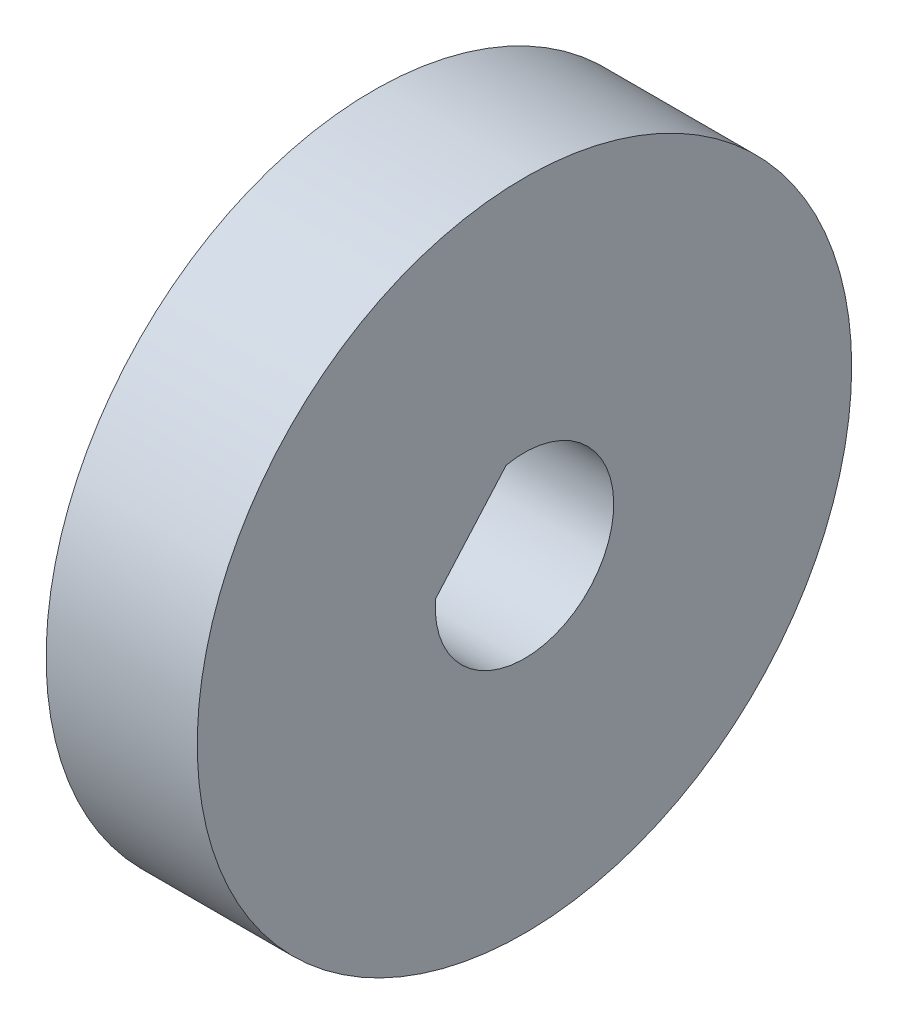
ISO-10303-21;
HEADER;
FILE_DESCRIPTION(('STEP AP214'),'2;1');
FILE_NAME('part.step','',(''),(''),'','','');
FILE_SCHEMA(('AUTOMOTIVE_DESIGN { 1 0 10303 214 1 1 1 1 }'));
ENDSEC;
DATA;
#1=APPLICATION_CONTEXT('core data for automotive mechanical design processes');
#2=APPLICATION_PROTOCOL_DEFINITION('international standard','automotive_design',2000,#1);
#3=PRODUCT_CONTEXT('',#1,'mechanical');
#4=PRODUCT('Part','Part','',(#3));
#5=PRODUCT_RELATED_PRODUCT_CATEGORY('part','',(#4));
#6=PRODUCT_DEFINITION_FORMATION('','',#4);
#7=PRODUCT_DEFINITION_CONTEXT('part definition',#1,'design');
#8=PRODUCT_DEFINITION('design','',#6,#7);
#9=PRODUCT_DEFINITION_SHAPE('','',#8);
#10=(LENGTH_UNIT() NAMED_UNIT(*) SI_UNIT(.MILLI.,.METRE.));
#11=(NAMED_UNIT(*) PLANE_ANGLE_UNIT() SI_UNIT($,.RADIAN.));
#12=(NAMED_UNIT(*) SI_UNIT($,.STERADIAN.) SOLID_ANGLE_UNIT());
#13=UNCERTAINTY_MEASURE_WITH_UNIT(LENGTH_MEASURE(1.E-05),#10,'distance_accuracy_value','');
#14=(GEOMETRIC_REPRESENTATION_CONTEXT(3) GLOBAL_UNCERTAINTY_ASSIGNED_CONTEXT((#13)) GLOBAL_UNIT_ASSIGNED_CONTEXT((#10,
#11,#12)) REPRESENTATION_CONTEXT('',''));
#15=CARTESIAN_POINT('',(0.,0.,0.));
#16=DIRECTION('',(0.,0.,1.));
#17=DIRECTION('',(1.,0.,0.));
#18=AXIS2_PLACEMENT_3D('',#15,#16,#17);
#19=CARTESIAN_POINT('',(5.08,0.,0.));
#20=DIRECTION('',(-1.,0.,0.));
#21=DIRECTION('',(0.,0.,1.));
#22=AXIS2_PLACEMENT_3D('',#19,#20,#21);
#23=CYLINDRICAL_SURFACE('',#22,11.);
#24=CARTESIAN_POINT('',(5.08,0.,0.));
#25=DIRECTION('',(1.,0.,0.));
#26=DIRECTION('',(0.,0.,-1.));
#27=AXIS2_PLACEMENT_3D('',#24,#25,#26);
#28=CIRCLE('',#27,11.);
#29=CARTESIAN_POINT('',(5.08,0.,-11.));
#30=VERTEX_POINT('',#29);
#31=EDGE_CURVE('E11',#30,#30,#28,.T.);
#32=ORIENTED_EDGE('',*,*,#31,.F.);
#33=EDGE_LOOP('',(#32));
#34=FACE_BOUND('',#33,.T.);
#35=CARTESIAN_POINT('',(0.,0.,0.));
#36=DIRECTION('',(1.,0.,0.));
#37=DIRECTION('',(0.,0.,-1.));
#38=AXIS2_PLACEMENT_3D('',#35,#36,#37);
#39=CIRCLE('',#38,11.);
#40=CARTESIAN_POINT('',(0.,0.,-11.));
#41=VERTEX_POINT('',#40);
#42=EDGE_CURVE('E35',#41,#41,#39,.T.);
#43=ORIENTED_EDGE('',*,*,#42,.T.);
#44=EDGE_LOOP('',(#43));
#45=FACE_BOUND('',#44,.T.);
#46=ADVANCED_FACE('F32',(#34,#45),#23,.T.);
#47=CARTESIAN_POINT('',(5.08,0.,0.));
#48=DIRECTION('',(1.,0.,0.));
#49=DIRECTION('',(0.,0.,-1.));
#50=AXIS2_PLACEMENT_3D('',#47,#48,#49);
#51=PLANE('',#50);
#52=CARTESIAN_POINT('',(5.08,0.,0.));
#53=DIRECTION('',(1.,0.,0.));
#54=DIRECTION('',(0.,0.,-1.));
#55=AXIS2_PLACEMENT_3D('',#52,#53,#54);
#56=CIRCLE('',#55,3.00000000000001);
#57=CARTESIAN_POINT('',(5.08,2.93621108774967,0.615357171223387));
#58=VERTEX_POINT('',#57);
#59=CARTESIAN_POINT('',(5.08,0.231396220195473,2.99106265218221));
#60=VERTEX_POINT('',#59);
#61=EDGE_CURVE('E67',#58,#60,#56,.F.);
#62=ORIENTED_EDGE('',*,*,#61,.T.);
#63=DIRECTION('',(0.,0.751337463209498,-0.659918189155229));
#64=VECTOR('',#63,1.);
#65=CARTESIAN_POINT('',(5.08,2.93621108774967,0.615357171223387));
#66=LINE('',#65,#64);
#67=EDGE_CURVE('E59',#60,#58,#66,.T.);
#68=ORIENTED_EDGE('',*,*,#67,.T.);
#69=EDGE_LOOP('',(#62,#68));
#70=FACE_BOUND('',#69,.T.);
#71=ORIENTED_EDGE('',*,*,#31,.T.);
#72=EDGE_LOOP('',(#71));
#73=FACE_BOUND('',#72,.T.);
#74=ADVANCED_FACE('F70',(#70,#73),#51,.T.);
#75=CARTESIAN_POINT('',(0.,0.,0.));
#76=DIRECTION('',(1.,0.,0.));
#77=DIRECTION('',(0.,0.,-1.));
#78=AXIS2_PLACEMENT_3D('',#75,#76,#77);
#79=PLANE('',#78);
#80=DIRECTION('',(0.,0.751337463209498,-0.659918189155229));
#81=VECTOR('',#80,1.);
#82=CARTESIAN_POINT('',(0.,2.93621108774967,0.615357171223387));
#83=LINE('',#82,#81);
#84=CARTESIAN_POINT('',(0.,0.231396220195473,2.99106265218221));
#85=VERTEX_POINT('',#84);
#86=CARTESIAN_POINT('',(0.,2.93621108774967,0.615357171223387));
#87=VERTEX_POINT('',#86);
#88=EDGE_CURVE('E68',#85,#87,#83,.T.);
#89=ORIENTED_EDGE('',*,*,#88,.F.);
#90=CARTESIAN_POINT('',(0.,0.,0.));
#91=DIRECTION('',(-1.,0.,0.));
#92=DIRECTION('',(0.,0.,1.));
#93=AXIS2_PLACEMENT_3D('',#90,#91,#92);
#94=CIRCLE('',#93,3.00000000000001);
#95=EDGE_CURVE('E53',#87,#85,#94,.T.);
#96=ORIENTED_EDGE('',*,*,#95,.F.);
#97=EDGE_LOOP('',(#89,#96));
#98=FACE_BOUND('',#97,.T.);
#99=ORIENTED_EDGE('',*,*,#42,.F.);
#100=EDGE_LOOP('',(#99));
#101=FACE_BOUND('',#100,.T.);
#102=ADVANCED_FACE('F77',(#98,#101),#79,.F.);
#103=CARTESIAN_POINT('',(5.081,0.,0.));
#104=DIRECTION('',(-1.,0.,0.));
#105=DIRECTION('',(0.,0.,1.));
#106=AXIS2_PLACEMENT_3D('',#103,#104,#105);
#107=CYLINDRICAL_SURFACE('',#106,3.00000000000001);
#108=DIRECTION('',(-1.,0.,0.));
#109=VECTOR('',#108,1.);
#110=CARTESIAN_POINT('',(5.081,2.93621108774967,0.615357171223387));
#111=LINE('',#110,#109);
#112=EDGE_CURVE('E46',#58,#87,#111,.T.);
#113=ORIENTED_EDGE('',*,*,#112,.T.);
#114=ORIENTED_EDGE('',*,*,#95,.T.);
#115=DIRECTION('',(-1.,0.,0.));
#116=VECTOR('',#115,1.);
#117=CARTESIAN_POINT('',(5.081,0.231396220195473,2.99106265218221));
#118=LINE('',#117,#116);
#119=EDGE_CURVE('E61',#60,#85,#118,.T.);
#120=ORIENTED_EDGE('',*,*,#119,.F.);
#121=ORIENTED_EDGE('',*,*,#61,.F.);
#122=EDGE_LOOP('',(#113,#114,#120,#121));
#123=FACE_BOUND('',#122,.T.);
#124=ADVANCED_FACE('F66',(#123),#107,.F.);
#125=CARTESIAN_POINT('',(5.081,2.93621108774967,0.615357171223387));
#126=DIRECTION('',(0.,0.659918189155229,0.751337463209498));
#127=DIRECTION('',(0.,-0.751337463209498,0.659918189155229));
#128=AXIS2_PLACEMENT_3D('',#125,#126,#127);
#129=PLANE('',#128);
#130=ORIENTED_EDGE('',*,*,#119,.T.);
#131=ORIENTED_EDGE('',*,*,#88,.T.);
#132=ORIENTED_EDGE('',*,*,#112,.F.);
#133=ORIENTED_EDGE('',*,*,#67,.F.);
#134=EDGE_LOOP('',(#130,#131,#132,#133));
#135=FACE_BOUND('',#134,.T.);
#136=ADVANCED_FACE('F60',(#135),#129,.F.);
#137=CLOSED_SHELL('',(#46,#74,#102,#124,#136));
#138=MANIFOLD_SOLID_BREP('B2',#137);
#139=ADVANCED_BREP_SHAPE_REPRESENTATION('',(#18,#138),#14);
#140=SHAPE_DEFINITION_REPRESENTATION(#9,#139);
ENDSEC;
END-ISO-10303-21;
